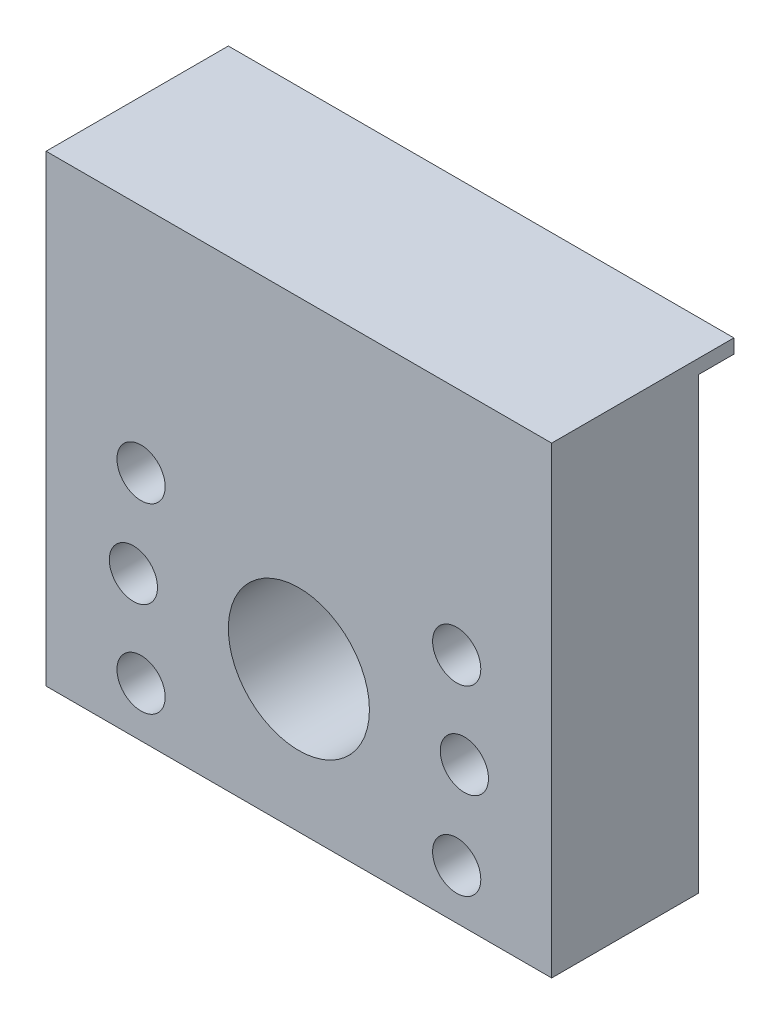
ISO-10303-21;
HEADER;
FILE_DESCRIPTION(('STEP AP214'),'2;1');
FILE_NAME('part.step','',(''),(''),'','','');
FILE_SCHEMA(('AUTOMOTIVE_DESIGN { 1 0 10303 214 1 1 1 1 }'));
ENDSEC;
DATA;
#1=APPLICATION_CONTEXT('core data for automotive mechanical design processes');
#2=APPLICATION_PROTOCOL_DEFINITION('international standard','automotive_design',2000,#1);
#3=PRODUCT_CONTEXT('',#1,'mechanical');
#4=PRODUCT('Part','Part','',(#3));
#5=PRODUCT_RELATED_PRODUCT_CATEGORY('part','',(#4));
#6=PRODUCT_DEFINITION_FORMATION('','',#4);
#7=PRODUCT_DEFINITION_CONTEXT('part definition',#1,'design');
#8=PRODUCT_DEFINITION('design','',#6,#7);
#9=PRODUCT_DEFINITION_SHAPE('','',#8);
#10=(LENGTH_UNIT() NAMED_UNIT(*) SI_UNIT(.MILLI.,.METRE.));
#11=(NAMED_UNIT(*) PLANE_ANGLE_UNIT() SI_UNIT($,.RADIAN.));
#12=(NAMED_UNIT(*) SI_UNIT($,.STERADIAN.) SOLID_ANGLE_UNIT());
#13=UNCERTAINTY_MEASURE_WITH_UNIT(LENGTH_MEASURE(1.E-05),#10,'distance_accuracy_value','');
#14=(GEOMETRIC_REPRESENTATION_CONTEXT(3) GLOBAL_UNCERTAINTY_ASSIGNED_CONTEXT((#13)) GLOBAL_UNIT_ASSIGNED_CONTEXT((#10,
#11,#12)) REPRESENTATION_CONTEXT('',''));
#15=CARTESIAN_POINT('',(0.,0.,0.));
#16=DIRECTION('',(0.,0.,1.));
#17=DIRECTION('',(1.,0.,0.));
#18=AXIS2_PLACEMENT_3D('',#15,#16,#17);
#19=CARTESIAN_POINT('',(0.,0.,0.));
#20=DIRECTION('',(0.,0.,1.));
#21=DIRECTION('',(1.,0.,0.));
#22=AXIS2_PLACEMENT_3D('',#19,#20,#21);
#23=PLANE('',#22);
#24=CARTESIAN_POINT('',(189.924999999999,-27.0999999999975,0.));
#25=DIRECTION('',(0.,0.,-1.));
#26=DIRECTION('',(-1.,0.,0.));
#27=AXIS2_PLACEMENT_3D('',#24,#25,#26);
#28=CIRCLE('',#27,2.04999999999999);
#29=CARTESIAN_POINT('',(187.874999999999,-27.0999999999975,0.));
#30=VERTEX_POINT('',#29);
#31=EDGE_CURVE('E223',#30,#30,#28,.T.);
#32=ORIENTED_EDGE('',*,*,#31,.F.);
#33=EDGE_LOOP('',(#32));
#34=FACE_BOUND('',#33,.T.);
#35=CARTESIAN_POINT('',(218.074999999999,-27.0999999999975,0.));
#36=DIRECTION('',(0.,0.,-1.));
#37=DIRECTION('',(-1.,0.,0.));
#38=AXIS2_PLACEMENT_3D('',#35,#36,#37);
#39=CIRCLE('',#38,2.04999999999999);
#40=CARTESIAN_POINT('',(216.024999999999,-27.0999999999975,0.));
#41=VERTEX_POINT('',#40);
#42=EDGE_CURVE('E217',#41,#41,#39,.T.);
#43=ORIENTED_EDGE('',*,*,#42,.F.);
#44=EDGE_LOOP('',(#43));
#45=FACE_BOUND('',#44,.T.);
#46=CARTESIAN_POINT('',(197.028495499532,-32.2749999999999,0.));
#47=DIRECTION('',(0.,0.,1.));
#48=DIRECTION('',(1.,0.,0.));
#49=AXIS2_PLACEMENT_3D('',#46,#47,#48);
#50=CIRCLE('',#49,1.59999999999999);
#51=CARTESIAN_POINT('',(198.628495499532,-32.2749999999999,0.));
#52=VERTEX_POINT('',#51);
#53=EDGE_CURVE('E12',#52,#52,#50,.F.);
#54=ORIENTED_EDGE('',*,*,#53,.F.);
#55=EDGE_LOOP('',(#54));
#56=FACE_BOUND('',#55,.T.);
#57=CARTESIAN_POINT('',(210.971504500461,-32.2749999999999,0.));
#58=DIRECTION('',(0.,0.,1.));
#59=DIRECTION('',(1.,0.,0.));
#60=AXIS2_PLACEMENT_3D('',#57,#58,#59);
#61=CIRCLE('',#60,1.59999999999999);
#62=CARTESIAN_POINT('',(212.571504500461,-32.2749999999999,0.));
#63=VERTEX_POINT('',#62);
#64=EDGE_CURVE('E51',#63,#63,#61,.F.);
#65=ORIENTED_EDGE('',*,*,#64,.F.);
#66=EDGE_LOOP('',(#65));
#67=FACE_BOUND('',#66,.T.);
#68=CARTESIAN_POINT('',(190.576606241341,-19.3499999999977,0.));
#69=DIRECTION('',(0.,0.,1.));
#70=DIRECTION('',(1.,0.,0.));
#71=AXIS2_PLACEMENT_3D('',#68,#69,#70);
#72=CIRCLE('',#71,2.04999999999999);
#73=CARTESIAN_POINT('',(192.626606241341,-19.3499999999977,0.));
#74=VERTEX_POINT('',#73);
#75=EDGE_CURVE('E122',#74,#74,#72,.T.);
#76=ORIENTED_EDGE('',*,*,#75,.T.);
#77=EDGE_LOOP('',(#76));
#78=FACE_BOUND('',#77,.T.);
#79=CARTESIAN_POINT('',(217.423393758658,-19.3499999999977,0.));
#80=DIRECTION('',(0.,0.,1.));
#81=DIRECTION('',(1.,0.,0.));
#82=AXIS2_PLACEMENT_3D('',#79,#80,#81);
#83=CIRCLE('',#82,2.04999999999999);
#84=CARTESIAN_POINT('',(219.473393758658,-19.3499999999977,0.));
#85=VERTEX_POINT('',#84);
#86=EDGE_CURVE('E128',#85,#85,#83,.T.);
#87=ORIENTED_EDGE('',*,*,#86,.T.);
#88=EDGE_LOOP('',(#87));
#89=FACE_BOUND('',#88,.T.);
#90=CARTESIAN_POINT('',(217.423393758658,-34.8499999999977,0.));
#91=DIRECTION('',(0.,0.,1.));
#92=DIRECTION('',(1.,0.,0.));
#93=AXIS2_PLACEMENT_3D('',#90,#91,#92);
#94=CIRCLE('',#93,2.04999999999999);
#95=CARTESIAN_POINT('',(219.473393758658,-34.8499999999977,0.));
#96=VERTEX_POINT('',#95);
#97=EDGE_CURVE('E160',#96,#96,#94,.T.);
#98=ORIENTED_EDGE('',*,*,#97,.T.);
#99=EDGE_LOOP('',(#98));
#100=FACE_BOUND('',#99,.T.);
#101=CARTESIAN_POINT('',(190.576606241341,-34.8499999999977,0.));
#102=DIRECTION('',(0.,0.,1.));
#103=DIRECTION('',(1.,0.,0.));
#104=AXIS2_PLACEMENT_3D('',#101,#102,#103);
#105=CIRCLE('',#104,2.04999999999999);
#106=CARTESIAN_POINT('',(192.626606241341,-34.8499999999977,0.));
#107=VERTEX_POINT('',#106);
#108=EDGE_CURVE('E164',#107,#107,#105,.T.);
#109=ORIENTED_EDGE('',*,*,#108,.T.);
#110=EDGE_LOOP('',(#109));
#111=FACE_BOUND('',#110,.T.);
#112=CARTESIAN_POINT('',(203.999999999999,-27.0999999999975,0.));
#113=DIRECTION('',(0.,0.,1.));
#114=DIRECTION('',(1.,0.,0.));
#115=AXIS2_PLACEMENT_3D('',#112,#113,#114);
#116=CIRCLE('',#115,5.99999999991495);
#117=CARTESIAN_POINT('',(209.999999999914,-27.0999999999975,0.));
#118=VERTEX_POINT('',#117);
#119=EDGE_CURVE('E142',#118,#118,#116,.T.);
#120=ORIENTED_EDGE('',*,*,#119,.T.);
#121=EDGE_LOOP('',(#120));
#122=FACE_BOUND('',#121,.T.);
#123=DIRECTION('',(-1.,0.,0.));
#124=VECTOR('',#123,1.);
#125=CARTESIAN_POINT('',(0.,-0.9,0.));
#126=LINE('',#125,#124);
#127=CARTESIAN_POINT('',(225.499999999998,-0.9,0.));
#128=VERTEX_POINT('',#127);
#129=CARTESIAN_POINT('',(182.500000000001,-0.9,0.));
#130=VERTEX_POINT('',#129);
#131=EDGE_CURVE('E67',#128,#130,#126,.T.);
#132=ORIENTED_EDGE('',*,*,#131,.F.);
#133=DIRECTION('',(0.,1.,0.));
#134=VECTOR('',#133,1.);
#135=CARTESIAN_POINT('',(225.499999999998,0.,0.));
#136=LINE('',#135,#134);
#137=CARTESIAN_POINT('',(225.499999999998,-39.0999999999977,0.));
#138=VERTEX_POINT('',#137);
#139=EDGE_CURVE('E116',#138,#128,#136,.T.);
#140=ORIENTED_EDGE('',*,*,#139,.F.);
#141=DIRECTION('',(1.,0.,0.));
#142=VECTOR('',#141,1.);
#143=CARTESIAN_POINT('',(0.,-39.0999999999977,0.));
#144=LINE('',#143,#142);
#145=CARTESIAN_POINT('',(182.500000000001,-39.0999999999977,0.));
#146=VERTEX_POINT('',#145);
#147=EDGE_CURVE('E106',#146,#138,#144,.T.);
#148=ORIENTED_EDGE('',*,*,#147,.F.);
#149=DIRECTION('',(0.,1.,0.));
#150=VECTOR('',#149,1.);
#151=CARTESIAN_POINT('',(182.500000000001,0.,0.));
#152=LINE('',#151,#150);
#153=EDGE_CURVE('E86',#146,#130,#152,.T.);
#154=ORIENTED_EDGE('',*,*,#153,.T.);
#155=EDGE_LOOP('',(#132,#140,#148,#154));
#156=FACE_BOUND('',#155,.T.);
#157=ADVANCED_FACE('F42',(#34,#45,#56,#67,#78,#89,#100,#111,#122,#156),#23,.F.);
#158=CARTESIAN_POINT('',(225.499999999998,0.,12.5));
#159=DIRECTION('',(-1.,0.,0.));
#160=DIRECTION('',(0.,0.,1.));
#161=AXIS2_PLACEMENT_3D('',#158,#159,#160);
#162=PLANE('',#161);
#163=DIRECTION('',(0.,1.,0.));
#164=VECTOR('',#163,1.);
#165=CARTESIAN_POINT('',(225.499999999998,0.,-3.));
#166=LINE('',#165,#164);
#167=CARTESIAN_POINT('',(225.499999999998,-0.9,-3.));
#168=VERTEX_POINT('',#167);
#169=CARTESIAN_POINT('',(225.499999999998,0.299999999999999,-3.));
#170=VERTEX_POINT('',#169);
#171=EDGE_CURVE('E141',#168,#170,#166,.T.);
#172=ORIENTED_EDGE('',*,*,#171,.T.);
#173=DIRECTION('',(0.,0.,-1.));
#174=VECTOR('',#173,1.);
#175=CARTESIAN_POINT('',(225.499999999998,0.299999999999999,12.5));
#176=LINE('',#175,#174);
#177=CARTESIAN_POINT('',(225.499999999998,0.299999999999999,12.5));
#178=VERTEX_POINT('',#177);
#179=EDGE_CURVE('E58',#178,#170,#176,.T.);
#180=ORIENTED_EDGE('',*,*,#179,.F.);
#181=DIRECTION('',(0.,1.,0.));
#182=VECTOR('',#181,1.);
#183=CARTESIAN_POINT('',(225.499999999998,0.,12.5));
#184=LINE('',#183,#182);
#185=CARTESIAN_POINT('',(225.499999999998,-39.0999999999977,12.5));
#186=VERTEX_POINT('',#185);
#187=EDGE_CURVE('E119',#186,#178,#184,.T.);
#188=ORIENTED_EDGE('',*,*,#187,.F.);
#189=DIRECTION('',(0.,0.,-1.));
#190=VECTOR('',#189,1.);
#191=CARTESIAN_POINT('',(225.499999999998,-39.0999999999977,12.5));
#192=LINE('',#191,#190);
#193=EDGE_CURVE('E109',#186,#138,#192,.T.);
#194=ORIENTED_EDGE('',*,*,#193,.T.);
#195=ORIENTED_EDGE('',*,*,#139,.T.);
#196=DIRECTION('',(0.,0.,1.));
#197=VECTOR('',#196,1.);
#198=CARTESIAN_POINT('',(225.499999999998,-0.9,-3.));
#199=LINE('',#198,#197);
#200=EDGE_CURVE('E135',#168,#128,#199,.T.);
#201=ORIENTED_EDGE('',*,*,#200,.F.);
#202=EDGE_LOOP('',(#172,#180,#188,#194,#195,#201));
#203=FACE_BOUND('',#202,.T.);
#204=ADVANCED_FACE('F115',(#203),#162,.F.);
#205=CARTESIAN_POINT('',(182.500000000001,0.,12.5));
#206=DIRECTION('',(-1.,0.,0.));
#207=DIRECTION('',(0.,0.,1.));
#208=AXIS2_PLACEMENT_3D('',#205,#206,#207);
#209=PLANE('',#208);
#210=DIRECTION('',(0.,0.,-1.));
#211=VECTOR('',#210,1.);
#212=CARTESIAN_POINT('',(182.500000000001,0.299999999999999,12.5));
#213=LINE('',#212,#211);
#214=CARTESIAN_POINT('',(182.500000000001,0.299999999999999,12.5));
#215=VERTEX_POINT('',#214);
#216=CARTESIAN_POINT('',(182.500000000001,0.299999999999999,-3.));
#217=VERTEX_POINT('',#216);
#218=EDGE_CURVE('E93',#215,#217,#213,.T.);
#219=ORIENTED_EDGE('',*,*,#218,.T.);
#220=DIRECTION('',(0.,1.,0.));
#221=VECTOR('',#220,1.);
#222=CARTESIAN_POINT('',(182.500000000001,0.,-3.));
#223=LINE('',#222,#221);
#224=CARTESIAN_POINT('',(182.500000000001,-0.9,-3.));
#225=VERTEX_POINT('',#224);
#226=EDGE_CURVE('E138',#225,#217,#223,.T.);
#227=ORIENTED_EDGE('',*,*,#226,.F.);
#228=DIRECTION('',(0.,0.,1.));
#229=VECTOR('',#228,1.);
#230=CARTESIAN_POINT('',(182.500000000001,-0.9,-3.));
#231=LINE('',#230,#229);
#232=EDGE_CURVE('E137',#225,#130,#231,.T.);
#233=ORIENTED_EDGE('',*,*,#232,.T.);
#234=ORIENTED_EDGE('',*,*,#153,.F.);
#235=DIRECTION('',(0.,0.,-1.));
#236=VECTOR('',#235,1.);
#237=CARTESIAN_POINT('',(182.500000000001,-39.0999999999977,12.5));
#238=LINE('',#237,#236);
#239=CARTESIAN_POINT('',(182.500000000001,-39.0999999999977,12.5));
#240=VERTEX_POINT('',#239);
#241=EDGE_CURVE('E104',#240,#146,#238,.T.);
#242=ORIENTED_EDGE('',*,*,#241,.F.);
#243=DIRECTION('',(0.,1.,0.));
#244=VECTOR('',#243,1.);
#245=CARTESIAN_POINT('',(182.500000000001,0.,12.5));
#246=LINE('',#245,#244);
#247=EDGE_CURVE('E176',#240,#215,#246,.T.);
#248=ORIENTED_EDGE('',*,*,#247,.T.);
#249=EDGE_LOOP('',(#219,#227,#233,#234,#242,#248));
#250=FACE_BOUND('',#249,.T.);
#251=ADVANCED_FACE('F276',(#250),#209,.T.);
#252=CARTESIAN_POINT('',(190.576606241341,-19.3499999999977,12.5));
#253=DIRECTION('',(0.,0.,-1.));
#254=DIRECTION('',(-1.,0.,0.));
#255=AXIS2_PLACEMENT_3D('',#252,#253,#254);
#256=CYLINDRICAL_SURFACE('',#255,2.04999999999999);
#257=CARTESIAN_POINT('',(190.576606241341,-19.3499999999977,12.5));
#258=DIRECTION('',(0.,0.,1.));
#259=DIRECTION('',(1.,0.,0.));
#260=AXIS2_PLACEMENT_3D('',#257,#258,#259);
#261=CIRCLE('',#260,2.04999999999999);
#262=CARTESIAN_POINT('',(192.626606241341,-19.3499999999977,12.5));
#263=VERTEX_POINT('',#262);
#264=EDGE_CURVE('E181',#263,#263,#261,.T.);
#265=ORIENTED_EDGE('',*,*,#264,.T.);
#266=EDGE_LOOP('',(#265));
#267=FACE_BOUND('',#266,.T.);
#268=ORIENTED_EDGE('',*,*,#75,.F.);
#269=EDGE_LOOP('',(#268));
#270=FACE_BOUND('',#269,.T.);
#271=ADVANCED_FACE('F279',(#267,#270),#256,.F.);
#272=CARTESIAN_POINT('',(217.423393758658,-19.3499999999977,12.5));
#273=DIRECTION('',(0.,0.,-1.));
#274=DIRECTION('',(-1.,0.,0.));
#275=AXIS2_PLACEMENT_3D('',#272,#273,#274);
#276=CYLINDRICAL_SURFACE('',#275,2.04999999999999);
#277=CARTESIAN_POINT('',(217.423393758658,-19.3499999999977,12.5));
#278=DIRECTION('',(0.,0.,1.));
#279=DIRECTION('',(1.,0.,0.));
#280=AXIS2_PLACEMENT_3D('',#277,#278,#279);
#281=CIRCLE('',#280,2.04999999999999);
#282=CARTESIAN_POINT('',(219.473393758658,-19.3499999999977,12.5));
#283=VERTEX_POINT('',#282);
#284=EDGE_CURVE('E185',#283,#283,#281,.T.);
#285=ORIENTED_EDGE('',*,*,#284,.T.);
#286=EDGE_LOOP('',(#285));
#287=FACE_BOUND('',#286,.T.);
#288=ORIENTED_EDGE('',*,*,#86,.F.);
#289=EDGE_LOOP('',(#288));
#290=FACE_BOUND('',#289,.T.);
#291=ADVANCED_FACE('F285',(#287,#290),#276,.F.);
#292=CARTESIAN_POINT('',(217.423393758658,-34.8499999999977,12.5));
#293=DIRECTION('',(0.,0.,-1.));
#294=DIRECTION('',(-1.,0.,0.));
#295=AXIS2_PLACEMENT_3D('',#292,#293,#294);
#296=CYLINDRICAL_SURFACE('',#295,2.04999999999999);
#297=CARTESIAN_POINT('',(217.423393758658,-34.8499999999977,12.5));
#298=DIRECTION('',(0.,0.,1.));
#299=DIRECTION('',(1.,0.,0.));
#300=AXIS2_PLACEMENT_3D('',#297,#298,#299);
#301=CIRCLE('',#300,2.04999999999999);
#302=CARTESIAN_POINT('',(219.473393758658,-34.8499999999977,12.5));
#303=VERTEX_POINT('',#302);
#304=EDGE_CURVE('E188',#303,#303,#301,.T.);
#305=ORIENTED_EDGE('',*,*,#304,.T.);
#306=EDGE_LOOP('',(#305));
#307=FACE_BOUND('',#306,.T.);
#308=ORIENTED_EDGE('',*,*,#97,.F.);
#309=EDGE_LOOP('',(#308));
#310=FACE_BOUND('',#309,.T.);
#311=ADVANCED_FACE('F289',(#307,#310),#296,.F.);
#312=CARTESIAN_POINT('',(190.576606241341,-34.8499999999977,12.5));
#313=DIRECTION('',(0.,0.,-1.));
#314=DIRECTION('',(-1.,0.,0.));
#315=AXIS2_PLACEMENT_3D('',#312,#313,#314);
#316=CYLINDRICAL_SURFACE('',#315,2.04999999999999);
#317=CARTESIAN_POINT('',(190.576606241341,-34.8499999999977,12.5));
#318=DIRECTION('',(0.,0.,1.));
#319=DIRECTION('',(1.,0.,0.));
#320=AXIS2_PLACEMENT_3D('',#317,#318,#319);
#321=CIRCLE('',#320,2.04999999999999);
#322=CARTESIAN_POINT('',(192.626606241341,-34.8499999999977,12.5));
#323=VERTEX_POINT('',#322);
#324=EDGE_CURVE('E191',#323,#323,#321,.T.);
#325=ORIENTED_EDGE('',*,*,#324,.T.);
#326=EDGE_LOOP('',(#325));
#327=FACE_BOUND('',#326,.T.);
#328=ORIENTED_EDGE('',*,*,#108,.F.);
#329=EDGE_LOOP('',(#328));
#330=FACE_BOUND('',#329,.T.);
#331=ADVANCED_FACE('F293',(#327,#330),#316,.F.);
#332=CARTESIAN_POINT('',(203.999999999999,-27.0999999999975,12.5));
#333=DIRECTION('',(0.,0.,-1.));
#334=DIRECTION('',(-1.,0.,0.));
#335=AXIS2_PLACEMENT_3D('',#332,#333,#334);
#336=CYLINDRICAL_SURFACE('',#335,5.99999999991495);
#337=CARTESIAN_POINT('',(203.999999999999,-27.0999999999975,12.5));
#338=DIRECTION('',(0.,0.,1.));
#339=DIRECTION('',(1.,0.,0.));
#340=AXIS2_PLACEMENT_3D('',#337,#338,#339);
#341=CIRCLE('',#340,5.99999999991495);
#342=CARTESIAN_POINT('',(209.999999999914,-27.0999999999975,12.5));
#343=VERTEX_POINT('',#342);
#344=EDGE_CURVE('E111',#343,#343,#341,.T.);
#345=ORIENTED_EDGE('',*,*,#344,.T.);
#346=EDGE_LOOP('',(#345));
#347=FACE_BOUND('',#346,.T.);
#348=ORIENTED_EDGE('',*,*,#119,.F.);
#349=EDGE_LOOP('',(#348));
#350=FACE_BOUND('',#349,.T.);
#351=ADVANCED_FACE('F275',(#347,#350),#336,.F.);
#352=CARTESIAN_POINT('',(0.,-39.0999999999977,12.5));
#353=DIRECTION('',(0.,1.,0.));
#354=DIRECTION('',(0.,0.,1.));
#355=AXIS2_PLACEMENT_3D('',#352,#353,#354);
#356=PLANE('',#355);
#357=ORIENTED_EDGE('',*,*,#147,.T.);
#358=ORIENTED_EDGE('',*,*,#193,.F.);
#359=DIRECTION('',(1.,0.,0.));
#360=VECTOR('',#359,1.);
#361=CARTESIAN_POINT('',(0.,-39.0999999999977,12.5));
#362=LINE('',#361,#360);
#363=EDGE_CURVE('E120',#240,#186,#362,.T.);
#364=ORIENTED_EDGE('',*,*,#363,.F.);
#365=ORIENTED_EDGE('',*,*,#241,.T.);
#366=EDGE_LOOP('',(#357,#358,#364,#365));
#367=FACE_BOUND('',#366,.T.);
#368=ADVANCED_FACE('F108',(#367),#356,.F.);
#369=CARTESIAN_POINT('',(0.,0.,12.5));
#370=DIRECTION('',(0.,0.,1.));
#371=DIRECTION('',(1.,0.,0.));
#372=AXIS2_PLACEMENT_3D('',#369,#370,#371);
#373=PLANE('',#372);
#374=CARTESIAN_POINT('',(189.924999999999,-27.0999999999975,12.5));
#375=DIRECTION('',(0.,0.,-1.));
#376=DIRECTION('',(-1.,0.,0.));
#377=AXIS2_PLACEMENT_3D('',#374,#375,#376);
#378=CIRCLE('',#377,2.04999999999999);
#379=CARTESIAN_POINT('',(187.874999999999,-27.0999999999975,12.5));
#380=VERTEX_POINT('',#379);
#381=EDGE_CURVE('E220',#380,#380,#378,.T.);
#382=ORIENTED_EDGE('',*,*,#381,.T.);
#383=EDGE_LOOP('',(#382));
#384=FACE_BOUND('',#383,.T.);
#385=CARTESIAN_POINT('',(218.074999999999,-27.0999999999975,12.5));
#386=DIRECTION('',(0.,0.,-1.));
#387=DIRECTION('',(-1.,0.,0.));
#388=AXIS2_PLACEMENT_3D('',#385,#386,#387);
#389=CIRCLE('',#388,2.04999999999999);
#390=CARTESIAN_POINT('',(216.024999999999,-27.0999999999975,12.5));
#391=VERTEX_POINT('',#390);
#392=EDGE_CURVE('E216',#391,#391,#389,.T.);
#393=ORIENTED_EDGE('',*,*,#392,.T.);
#394=EDGE_LOOP('',(#393));
#395=FACE_BOUND('',#394,.T.);
#396=DIRECTION('',(-1.,0.,0.));
#397=VECTOR('',#396,1.);
#398=CARTESIAN_POINT('',(0.,0.299999999999999,12.5));
#399=LINE('',#398,#397);
#400=EDGE_CURVE('E201',#178,#215,#399,.T.);
#401=ORIENTED_EDGE('',*,*,#400,.T.);
#402=ORIENTED_EDGE('',*,*,#247,.F.);
#403=ORIENTED_EDGE('',*,*,#363,.T.);
#404=ORIENTED_EDGE('',*,*,#187,.T.);
#405=EDGE_LOOP('',(#401,#402,#403,#404));
#406=FACE_BOUND('',#405,.T.);
#407=ORIENTED_EDGE('',*,*,#344,.F.);
#408=EDGE_LOOP('',(#407));
#409=FACE_BOUND('',#408,.T.);
#410=ORIENTED_EDGE('',*,*,#324,.F.);
#411=EDGE_LOOP('',(#410));
#412=FACE_BOUND('',#411,.T.);
#413=ORIENTED_EDGE('',*,*,#304,.F.);
#414=EDGE_LOOP('',(#413));
#415=FACE_BOUND('',#414,.T.);
#416=ORIENTED_EDGE('',*,*,#284,.F.);
#417=EDGE_LOOP('',(#416));
#418=FACE_BOUND('',#417,.T.);
#419=ORIENTED_EDGE('',*,*,#264,.F.);
#420=EDGE_LOOP('',(#419));
#421=FACE_BOUND('',#420,.T.);
#422=ADVANCED_FACE('F230',(#384,#395,#406,#409,#412,#415,#418,#421),#373,.T.);
#423=CARTESIAN_POINT('',(0.,-0.9,-3.));
#424=DIRECTION('',(0.,1.,0.));
#425=DIRECTION('',(-1.,0.,0.));
#426=AXIS2_PLACEMENT_3D('',#423,#424,#425);
#427=PLANE('',#426);
#428=ORIENTED_EDGE('',*,*,#131,.T.);
#429=ORIENTED_EDGE('',*,*,#232,.F.);
#430=DIRECTION('',(-1.,0.,0.));
#431=VECTOR('',#430,1.);
#432=CARTESIAN_POINT('',(0.,-0.9,-3.));
#433=LINE('',#432,#431);
#434=EDGE_CURVE('E134',#168,#225,#433,.T.);
#435=ORIENTED_EDGE('',*,*,#434,.F.);
#436=ORIENTED_EDGE('',*,*,#200,.T.);
#437=EDGE_LOOP('',(#428,#429,#435,#436));
#438=FACE_BOUND('',#437,.T.);
#439=ADVANCED_FACE('F44',(#438),#427,.F.);
#440=CARTESIAN_POINT('',(0.,0.,-3.));
#441=DIRECTION('',(0.,0.,1.));
#442=DIRECTION('',(1.,0.,0.));
#443=AXIS2_PLACEMENT_3D('',#440,#441,#442);
#444=PLANE('',#443);
#445=ORIENTED_EDGE('',*,*,#226,.T.);
#446=DIRECTION('',(-1.,0.,0.));
#447=VECTOR('',#446,1.);
#448=CARTESIAN_POINT('',(0.,0.299999999999999,-3.));
#449=LINE('',#448,#447);
#450=EDGE_CURVE('E204',#170,#217,#449,.T.);
#451=ORIENTED_EDGE('',*,*,#450,.F.);
#452=ORIENTED_EDGE('',*,*,#171,.F.);
#453=ORIENTED_EDGE('',*,*,#434,.T.);
#454=EDGE_LOOP('',(#445,#451,#452,#453));
#455=FACE_BOUND('',#454,.T.);
#456=ADVANCED_FACE('F267',(#455),#444,.F.);
#457=CARTESIAN_POINT('',(0.,0.299999999999999,12.5));
#458=DIRECTION('',(0.,-1.,0.));
#459=DIRECTION('',(0.,0.,-1.));
#460=AXIS2_PLACEMENT_3D('',#457,#458,#459);
#461=PLANE('',#460);
#462=ORIENTED_EDGE('',*,*,#450,.T.);
#463=ORIENTED_EDGE('',*,*,#218,.F.);
#464=ORIENTED_EDGE('',*,*,#400,.F.);
#465=ORIENTED_EDGE('',*,*,#179,.T.);
#466=EDGE_LOOP('',(#462,#463,#464,#465));
#467=FACE_BOUND('',#466,.T.);
#468=ADVANCED_FACE('F263',(#467),#461,.F.);
#469=CARTESIAN_POINT('',(210.971504500461,-32.2749999999999,-3.));
#470=DIRECTION('',(0.,0.,1.));
#471=DIRECTION('',(1.,0.,0.));
#472=AXIS2_PLACEMENT_3D('',#469,#470,#471);
#473=CYLINDRICAL_SURFACE('',#472,1.59999999999999);
#474=CARTESIAN_POINT('',(210.971504500461,-32.2749999999999,-3.));
#475=DIRECTION('',(0.,0.,-1.));
#476=DIRECTION('',(-1.,0.,0.));
#477=AXIS2_PLACEMENT_3D('',#474,#475,#476);
#478=CIRCLE('',#477,1.59999999999999);
#479=CARTESIAN_POINT('',(209.371504500461,-32.2749999999999,-3.));
#480=VERTEX_POINT('',#479);
#481=EDGE_CURVE('E206',#480,#480,#478,.T.);
#482=ORIENTED_EDGE('',*,*,#481,.F.);
#483=EDGE_LOOP('',(#482));
#484=FACE_BOUND('',#483,.T.);
#485=ORIENTED_EDGE('',*,*,#64,.T.);
#486=EDGE_LOOP('',(#485));
#487=FACE_BOUND('',#486,.T.);
#488=ADVANCED_FACE('F146',(#484,#487),#473,.T.);
#489=CARTESIAN_POINT('',(210.971504500461,-32.2749999999999,-3.));
#490=DIRECTION('',(0.,0.,-1.));
#491=DIRECTION('',(-1.,0.,0.));
#492=AXIS2_PLACEMENT_3D('',#489,#490,#491);
#493=PLANE('',#492);
#494=ORIENTED_EDGE('',*,*,#481,.T.);
#495=EDGE_LOOP('',(#494));
#496=FACE_BOUND('',#495,.T.);
#497=ADVANCED_FACE('F247',(#496),#493,.T.);
#498=CARTESIAN_POINT('',(197.028495499532,-32.2749999999999,-3.));
#499=DIRECTION('',(0.,0.,1.));
#500=DIRECTION('',(1.,0.,0.));
#501=AXIS2_PLACEMENT_3D('',#498,#499,#500);
#502=CYLINDRICAL_SURFACE('',#501,1.59999999999999);
#503=CARTESIAN_POINT('',(197.028495499532,-32.2749999999999,-3.));
#504=DIRECTION('',(0.,0.,-1.));
#505=DIRECTION('',(-1.,0.,0.));
#506=AXIS2_PLACEMENT_3D('',#503,#504,#505);
#507=CIRCLE('',#506,1.59999999999999);
#508=CARTESIAN_POINT('',(195.428495499532,-32.2749999999999,-3.));
#509=VERTEX_POINT('',#508);
#510=EDGE_CURVE('E212',#509,#509,#507,.T.);
#511=ORIENTED_EDGE('',*,*,#510,.F.);
#512=EDGE_LOOP('',(#511));
#513=FACE_BOUND('',#512,.T.);
#514=ORIENTED_EDGE('',*,*,#53,.T.);
#515=EDGE_LOOP('',(#514));
#516=FACE_BOUND('',#515,.T.);
#517=ADVANCED_FACE('F244',(#513,#516),#502,.T.);
#518=CARTESIAN_POINT('',(197.028495499532,-32.2749999999999,-3.));
#519=DIRECTION('',(0.,0.,-1.));
#520=DIRECTION('',(-1.,0.,0.));
#521=AXIS2_PLACEMENT_3D('',#518,#519,#520);
#522=PLANE('',#521);
#523=ORIENTED_EDGE('',*,*,#510,.T.);
#524=EDGE_LOOP('',(#523));
#525=FACE_BOUND('',#524,.T.);
#526=ADVANCED_FACE('F246',(#525),#522,.T.);
#527=CARTESIAN_POINT('',(218.074999999999,-27.0999999999975,12.5));
#528=DIRECTION('',(0.,0.,-1.));
#529=DIRECTION('',(-1.,0.,0.));
#530=AXIS2_PLACEMENT_3D('',#527,#528,#529);
#531=CYLINDRICAL_SURFACE('',#530,2.04999999999999);
#532=ORIENTED_EDGE('',*,*,#392,.F.);
#533=EDGE_LOOP('',(#532));
#534=FACE_BOUND('',#533,.T.);
#535=ORIENTED_EDGE('',*,*,#42,.T.);
#536=EDGE_LOOP('',(#535));
#537=FACE_BOUND('',#536,.T.);
#538=ADVANCED_FACE('F236',(#534,#537),#531,.F.);
#539=CARTESIAN_POINT('',(189.924999999999,-27.0999999999975,12.5));
#540=DIRECTION('',(0.,0.,-1.));
#541=DIRECTION('',(-1.,0.,0.));
#542=AXIS2_PLACEMENT_3D('',#539,#540,#541);
#543=CYLINDRICAL_SURFACE('',#542,2.04999999999999);
#544=ORIENTED_EDGE('',*,*,#381,.F.);
#545=EDGE_LOOP('',(#544));
#546=FACE_BOUND('',#545,.T.);
#547=ORIENTED_EDGE('',*,*,#31,.T.);
#548=EDGE_LOOP('',(#547));
#549=FACE_BOUND('',#548,.T.);
#550=ADVANCED_FACE('F233',(#546,#549),#543,.F.);
#551=CLOSED_SHELL('',(#157,#204,#251,#271,#291,#311,#331,#351,#368,#422,#439,#456,#468,#488,
#497,#517,#526,#538,#550));
#552=MANIFOLD_SOLID_BREP('B2',#551);
#553=ADVANCED_BREP_SHAPE_REPRESENTATION('',(#18,#552),#14);
#554=SHAPE_DEFINITION_REPRESENTATION(#9,#553);
ENDSEC;
END-ISO-10303-21;
